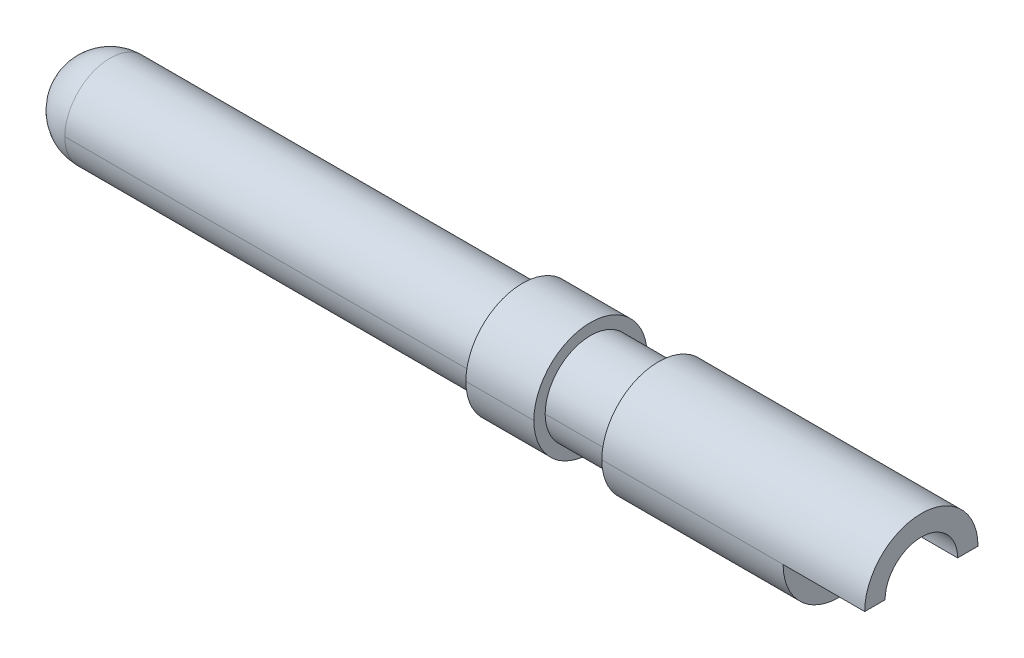
ISO-10303-21;
HEADER;
FILE_DESCRIPTION(('STEP AP214'),'2;1');
FILE_NAME('part.step','',(''),(''),'','','');
FILE_SCHEMA(('AUTOMOTIVE_DESIGN { 1 0 10303 214 1 1 1 1 }'));
ENDSEC;
DATA;
#1=APPLICATION_CONTEXT('core data for automotive mechanical design processes');
#2=APPLICATION_PROTOCOL_DEFINITION('international standard','automotive_design',2000,#1);
#3=PRODUCT_CONTEXT('',#1,'mechanical');
#4=PRODUCT('Part','Part','',(#3));
#5=PRODUCT_RELATED_PRODUCT_CATEGORY('part','',(#4));
#6=PRODUCT_DEFINITION_FORMATION('','',#4);
#7=PRODUCT_DEFINITION_CONTEXT('part definition',#1,'design');
#8=PRODUCT_DEFINITION('design','',#6,#7);
#9=PRODUCT_DEFINITION_SHAPE('','',#8);
#10=(LENGTH_UNIT() NAMED_UNIT(*) SI_UNIT(.MILLI.,.METRE.));
#11=(NAMED_UNIT(*) PLANE_ANGLE_UNIT() SI_UNIT($,.RADIAN.));
#12=(NAMED_UNIT(*) SI_UNIT($,.STERADIAN.) SOLID_ANGLE_UNIT());
#13=UNCERTAINTY_MEASURE_WITH_UNIT(LENGTH_MEASURE(1.E-05),#10,'distance_accuracy_value','');
#14=(GEOMETRIC_REPRESENTATION_CONTEXT(3) GLOBAL_UNCERTAINTY_ASSIGNED_CONTEXT((#13)) GLOBAL_UNIT_ASSIGNED_CONTEXT((#10,
#11,#12)) REPRESENTATION_CONTEXT('',''));
#15=CARTESIAN_POINT('',(0.,0.,0.));
#16=DIRECTION('',(0.,0.,1.));
#17=DIRECTION('',(1.,0.,0.));
#18=AXIS2_PLACEMENT_3D('',#15,#16,#17);
#19=CARTESIAN_POINT('',(-2.00000000012324,0.,0.));
#20=DIRECTION('',(1.,0.,0.));
#21=DIRECTION('',(0.,0.,-1.));
#22=AXIS2_PLACEMENT_3D('',#19,#20,#21);
#23=CONICAL_SURFACE('',#22,0.799999999799184,1.0471975507193);
#24=DIRECTION('',(0.500000000413349,0.,0.866025403545792));
#25=VECTOR('',#24,1.);
#26=CARTESIAN_POINT('',(-2.00000000012324,0.,0.799999999799184));
#27=LINE('',#26,#25);
#28=CARTESIAN_POINT('',(-2.46188021543503,2.8421709430404E-10,0.));
#29=VERTEX_POINT('',#28);
#30=CARTESIAN_POINT('',(-2.,0.,0.800000000012639));
#31=VERTEX_POINT('',#30);
#32=EDGE_CURVE('E192',#29,#31,#27,.T.);
#33=ORIENTED_EDGE('',*,*,#32,.F.);
#34=DIRECTION('',(0.500000000413349,0.,-0.866025403545792));
#35=VECTOR('',#34,1.);
#36=CARTESIAN_POINT('',(-2.00000000012324,0.,-0.799999999799184));
#37=LINE('',#36,#35);
#38=CARTESIAN_POINT('',(-2.,0.,-0.800000000012639));
#39=VERTEX_POINT('',#38);
#40=EDGE_CURVE('E197',#29,#39,#37,.T.);
#41=ORIENTED_EDGE('',*,*,#40,.T.);
#42=CARTESIAN_POINT('',(-2.,0.,0.));
#43=DIRECTION('',(1.,0.,0.));
#44=DIRECTION('',(0.,0.,-1.));
#45=AXIS2_PLACEMENT_3D('',#42,#43,#44);
#46=CIRCLE('',#45,0.8);
#47=EDGE_CURVE('E11',#39,#31,#46,.T.);
#48=ORIENTED_EDGE('',*,*,#47,.T.);
#49=EDGE_LOOP('',(#33,#41,#48));
#50=FACE_BOUND('',#49,.T.);
#51=ADVANCED_FACE('F17',(#50),#23,.F.);
#52=CARTESIAN_POINT('',(-19.845,0.,0.));
#53=DIRECTION('',(1.,0.,0.));
#54=DIRECTION('',(0.,0.,-1.));
#55=AXIS2_PLACEMENT_3D('',#52,#53,#54);
#56=CYLINDRICAL_SURFACE('',#55,0.8);
#57=DIRECTION('',(1.,0.,0.));
#58=VECTOR('',#57,1.);
#59=CARTESIAN_POINT('',(-19.845,0.,0.8));
#60=LINE('',#59,#58);
#61=CARTESIAN_POINT('',(-1.8,0.,0.8));
#62=VERTEX_POINT('',#61);
#63=EDGE_CURVE('E179',#31,#62,#60,.T.);
#64=ORIENTED_EDGE('',*,*,#63,.F.);
#65=ORIENTED_EDGE('',*,*,#47,.F.);
#66=DIRECTION('',(1.,0.,0.));
#67=VECTOR('',#66,1.);
#68=CARTESIAN_POINT('',(-19.845,0.,-0.8));
#69=LINE('',#68,#67);
#70=CARTESIAN_POINT('',(-1.8,0.,-0.8));
#71=VERTEX_POINT('',#70);
#72=EDGE_CURVE('E217',#39,#71,#69,.T.);
#73=ORIENTED_EDGE('',*,*,#72,.T.);
#74=DIRECTION('',(1.,0.,0.));
#75=VECTOR('',#74,1.);
#76=CARTESIAN_POINT('',(0.,0.,-0.8));
#77=LINE('',#76,#75);
#78=CARTESIAN_POINT('',(0.,0.,-0.8));
#79=VERTEX_POINT('',#78);
#80=EDGE_CURVE('E28',#71,#79,#77,.T.);
#81=ORIENTED_EDGE('',*,*,#80,.T.);
#82=CARTESIAN_POINT('',(0.,0.,0.));
#83=DIRECTION('',(-1.,0.,0.));
#84=DIRECTION('',(0.,0.,-1.));
#85=AXIS2_PLACEMENT_3D('',#82,#83,#84);
#86=CIRCLE('',#85,0.8);
#87=CARTESIAN_POINT('',(0.,0.,0.8));
#88=VERTEX_POINT('',#87);
#89=EDGE_CURVE('E203',#88,#79,#86,.T.);
#90=ORIENTED_EDGE('',*,*,#89,.F.);
#91=DIRECTION('',(-1.,0.,0.));
#92=VECTOR('',#91,1.);
#93=CARTESIAN_POINT('',(0.,0.,0.8));
#94=LINE('',#93,#92);
#95=EDGE_CURVE('E43',#88,#62,#94,.T.);
#96=ORIENTED_EDGE('',*,*,#95,.T.);
#97=EDGE_LOOP('',(#64,#65,#73,#81,#90,#96));
#98=FACE_BOUND('',#97,.T.);
#99=ADVANCED_FACE('F319',(#98),#56,.F.);
#100=CARTESIAN_POINT('',(0.,0.,2.405));
#101=DIRECTION('',(0.,1.,0.));
#102=DIRECTION('',(1.,0.,0.));
#103=AXIS2_PLACEMENT_3D('',#100,#101,#102);
#104=PLANE('',#103);
#105=DIRECTION('',(0.,0.,-1.));
#106=VECTOR('',#105,1.);
#107=CARTESIAN_POINT('',(-1.8,0.,2.405));
#108=LINE('',#107,#106);
#109=CARTESIAN_POINT('',(-1.8,0.,-1.25));
#110=VERTEX_POINT('',#109);
#111=EDGE_CURVE('E174',#71,#110,#108,.T.);
#112=ORIENTED_EDGE('',*,*,#111,.T.);
#113=DIRECTION('',(-1.,0.,0.));
#114=VECTOR('',#113,1.);
#115=CARTESIAN_POINT('',(-19.845,0.,-1.25));
#116=LINE('',#115,#114);
#117=CARTESIAN_POINT('',(0.,0.,-1.25));
#118=VERTEX_POINT('',#117);
#119=EDGE_CURVE('E185',#118,#110,#116,.T.);
#120=ORIENTED_EDGE('',*,*,#119,.F.);
#121=DIRECTION('',(0.,0.,-1.));
#122=VECTOR('',#121,1.);
#123=CARTESIAN_POINT('',(0.,0.,0.));
#124=LINE('',#123,#122);
#125=EDGE_CURVE('E257',#79,#118,#124,.T.);
#126=ORIENTED_EDGE('',*,*,#125,.F.);
#127=ORIENTED_EDGE('',*,*,#80,.F.);
#128=EDGE_LOOP('',(#112,#120,#126,#127));
#129=FACE_BOUND('',#128,.T.);
#130=ADVANCED_FACE('F324',(#129),#104,.F.);
#131=CARTESIAN_POINT('',(-1.8,0.,2.405));
#132=DIRECTION('',(-1.,0.,0.));
#133=DIRECTION('',(0.,0.,1.));
#134=AXIS2_PLACEMENT_3D('',#131,#132,#133);
#135=PLANE('',#134);
#136=ORIENTED_EDGE('',*,*,#111,.F.);
#137=CARTESIAN_POINT('',(-1.8,0.,0.));
#138=DIRECTION('',(1.,0.,0.));
#139=DIRECTION('',(0.,0.,-1.));
#140=AXIS2_PLACEMENT_3D('',#137,#138,#139);
#141=CIRCLE('',#140,0.8);
#142=EDGE_CURVE('E221',#62,#71,#141,.T.);
#143=ORIENTED_EDGE('',*,*,#142,.F.);
#144=DIRECTION('',(0.,0.,1.));
#145=VECTOR('',#144,1.);
#146=CARTESIAN_POINT('',(-1.8,0.,2.405));
#147=LINE('',#146,#145);
#148=CARTESIAN_POINT('',(-1.8,0.,1.25));
#149=VERTEX_POINT('',#148);
#150=EDGE_CURVE('E207',#62,#149,#147,.T.);
#151=ORIENTED_EDGE('',*,*,#150,.T.);
#152=CARTESIAN_POINT('',(-1.8,0.,0.));
#153=DIRECTION('',(-1.,0.,0.));
#154=DIRECTION('',(0.,0.,-1.));
#155=AXIS2_PLACEMENT_3D('',#152,#153,#154);
#156=CIRCLE('',#155,1.25);
#157=EDGE_CURVE('E278',#110,#149,#156,.T.);
#158=ORIENTED_EDGE('',*,*,#157,.F.);
#159=EDGE_LOOP('',(#136,#143,#151,#158));
#160=FACE_BOUND('',#159,.T.);
#161=ADVANCED_FACE('F19',(#160),#135,.F.);
#162=CARTESIAN_POINT('',(0.,0.,2.405));
#163=DIRECTION('',(0.,1.,0.));
#164=DIRECTION('',(1.,0.,0.));
#165=AXIS2_PLACEMENT_3D('',#162,#163,#164);
#166=PLANE('',#165);
#167=ORIENTED_EDGE('',*,*,#150,.F.);
#168=ORIENTED_EDGE('',*,*,#95,.F.);
#169=DIRECTION('',(0.,0.,-1.));
#170=VECTOR('',#169,1.);
#171=CARTESIAN_POINT('',(0.,0.,0.));
#172=LINE('',#171,#170);
#173=CARTESIAN_POINT('',(0.,0.,1.25));
#174=VERTEX_POINT('',#173);
#175=EDGE_CURVE('E208',#174,#88,#172,.T.);
#176=ORIENTED_EDGE('',*,*,#175,.F.);
#177=DIRECTION('',(1.,0.,0.));
#178=VECTOR('',#177,1.);
#179=CARTESIAN_POINT('',(-19.845,0.,1.25));
#180=LINE('',#179,#178);
#181=EDGE_CURVE('E21',#149,#174,#180,.T.);
#182=ORIENTED_EDGE('',*,*,#181,.F.);
#183=EDGE_LOOP('',(#167,#168,#176,#182));
#184=FACE_BOUND('',#183,.T.);
#185=ADVANCED_FACE('F375',(#184),#166,.F.);
#186=CARTESIAN_POINT('',(0.,0.,0.));
#187=DIRECTION('',(1.,0.,0.));
#188=DIRECTION('',(0.,1.,0.));
#189=AXIS2_PLACEMENT_3D('',#186,#187,#188);
#190=PLANE('',#189);
#191=ORIENTED_EDGE('',*,*,#125,.T.);
#192=CARTESIAN_POINT('',(0.,0.,0.));
#193=DIRECTION('',(-1.,0.,0.));
#194=DIRECTION('',(0.,0.,-1.));
#195=AXIS2_PLACEMENT_3D('',#192,#193,#194);
#196=CIRCLE('',#195,1.25);
#197=EDGE_CURVE('E181',#174,#118,#196,.T.);
#198=ORIENTED_EDGE('',*,*,#197,.F.);
#199=ORIENTED_EDGE('',*,*,#175,.T.);
#200=ORIENTED_EDGE('',*,*,#89,.T.);
#201=EDGE_LOOP('',(#191,#198,#199,#200));
#202=FACE_BOUND('',#201,.T.);
#203=ADVANCED_FACE('F314',(#202),#190,.T.);
#204=CARTESIAN_POINT('',(-19.845,0.,0.));
#205=DIRECTION('',(1.,0.,0.));
#206=DIRECTION('',(0.,0.,-1.));
#207=AXIS2_PLACEMENT_3D('',#204,#205,#206);
#208=CYLINDRICAL_SURFACE('',#207,1.25);
#209=DIRECTION('',(1.,0.,0.));
#210=VECTOR('',#209,1.);
#211=CARTESIAN_POINT('',(-19.845,0.,1.25));
#212=LINE('',#211,#210);
#213=CARTESIAN_POINT('',(-5.8,0.,1.25));
#214=VERTEX_POINT('',#213);
#215=EDGE_CURVE('E225',#214,#149,#212,.T.);
#216=ORIENTED_EDGE('',*,*,#215,.F.);
#217=CARTESIAN_POINT('',(-5.8,0.,0.));
#218=DIRECTION('',(1.,0.,0.));
#219=DIRECTION('',(0.,0.,-1.));
#220=AXIS2_PLACEMENT_3D('',#217,#218,#219);
#221=CIRCLE('',#220,1.25);
#222=CARTESIAN_POINT('',(-5.8,0.,-1.25));
#223=VERTEX_POINT('',#222);
#224=EDGE_CURVE('E231',#214,#223,#221,.T.);
#225=ORIENTED_EDGE('',*,*,#224,.T.);
#226=DIRECTION('',(1.,0.,0.));
#227=VECTOR('',#226,1.);
#228=CARTESIAN_POINT('',(-19.845,0.,-1.25));
#229=LINE('',#228,#227);
#230=EDGE_CURVE('E180',#223,#110,#229,.T.);
#231=ORIENTED_EDGE('',*,*,#230,.T.);
#232=ORIENTED_EDGE('',*,*,#157,.T.);
#233=EDGE_LOOP('',(#216,#225,#231,#232));
#234=FACE_BOUND('',#233,.T.);
#235=ADVANCED_FACE('F293',(#234),#208,.T.);
#236=CARTESIAN_POINT('',(-5.8,0.,0.));
#237=DIRECTION('',(1.,0.,0.));
#238=DIRECTION('',(0.,1.,0.));
#239=AXIS2_PLACEMENT_3D('',#236,#237,#238);
#240=PLANE('',#239);
#241=CARTESIAN_POINT('',(-5.8,0.,0.));
#242=DIRECTION('',(-1.,0.,0.));
#243=DIRECTION('',(0.,0.,-1.));
#244=AXIS2_PLACEMENT_3D('',#241,#242,#243);
#245=CIRCLE('',#244,1.);
#246=CARTESIAN_POINT('',(-5.8,0.,-1.));
#247=VERTEX_POINT('',#246);
#248=CARTESIAN_POINT('',(-5.8,0.,1.));
#249=VERTEX_POINT('',#248);
#250=EDGE_CURVE('E228',#247,#249,#245,.T.);
#251=ORIENTED_EDGE('',*,*,#250,.F.);
#252=CARTESIAN_POINT('',(-5.8,0.,0.));
#253=DIRECTION('',(-1.,0.,0.));
#254=DIRECTION('',(0.,0.,-1.));
#255=AXIS2_PLACEMENT_3D('',#252,#253,#254);
#256=CIRCLE('',#255,1.);
#257=EDGE_CURVE('E216',#249,#247,#256,.T.);
#258=ORIENTED_EDGE('',*,*,#257,.F.);
#259=EDGE_LOOP('',(#251,#258));
#260=FACE_BOUND('',#259,.T.);
#261=CARTESIAN_POINT('',(-5.8,0.,0.));
#262=DIRECTION('',(1.,0.,0.));
#263=DIRECTION('',(0.,0.,-1.));
#264=AXIS2_PLACEMENT_3D('',#261,#262,#263);
#265=CIRCLE('',#264,1.25);
#266=EDGE_CURVE('E215',#223,#214,#265,.T.);
#267=ORIENTED_EDGE('',*,*,#266,.F.);
#268=ORIENTED_EDGE('',*,*,#224,.F.);
#269=EDGE_LOOP('',(#267,#268));
#270=FACE_BOUND('',#269,.T.);
#271=ADVANCED_FACE('F301',(#260,#270),#240,.F.);
#272=CARTESIAN_POINT('',(-19.845,0.,0.));
#273=DIRECTION('',(1.,0.,0.));
#274=DIRECTION('',(0.,0.,-1.));
#275=AXIS2_PLACEMENT_3D('',#272,#273,#274);
#276=CYLINDRICAL_SURFACE('',#275,1.);
#277=DIRECTION('',(1.,0.,0.));
#278=VECTOR('',#277,1.);
#279=CARTESIAN_POINT('',(-19.845,0.,1.));
#280=LINE('',#279,#278);
#281=CARTESIAN_POINT('',(-7.3,0.,1.));
#282=VERTEX_POINT('',#281);
#283=EDGE_CURVE('E272',#282,#249,#280,.T.);
#284=ORIENTED_EDGE('',*,*,#283,.F.);
#285=CARTESIAN_POINT('',(-7.3,0.,0.));
#286=DIRECTION('',(-1.,0.,0.));
#287=DIRECTION('',(0.,0.,-1.));
#288=AXIS2_PLACEMENT_3D('',#285,#286,#287);
#289=CIRCLE('',#288,1.);
#290=CARTESIAN_POINT('',(-7.3,0.,-1.));
#291=VERTEX_POINT('',#290);
#292=EDGE_CURVE('E232',#291,#282,#289,.T.);
#293=ORIENTED_EDGE('',*,*,#292,.F.);
#294=DIRECTION('',(1.,0.,0.));
#295=VECTOR('',#294,1.);
#296=CARTESIAN_POINT('',(-19.845,0.,-1.));
#297=LINE('',#296,#295);
#298=EDGE_CURVE('E211',#291,#247,#297,.T.);
#299=ORIENTED_EDGE('',*,*,#298,.T.);
#300=ORIENTED_EDGE('',*,*,#250,.T.);
#301=EDGE_LOOP('',(#284,#293,#299,#300));
#302=FACE_BOUND('',#301,.T.);
#303=ADVANCED_FACE('F303',(#302),#276,.T.);
#304=CARTESIAN_POINT('',(-7.3,0.,0.));
#305=DIRECTION('',(1.,0.,0.));
#306=DIRECTION('',(0.,1.,0.));
#307=AXIS2_PLACEMENT_3D('',#304,#305,#306);
#308=PLANE('',#307);
#309=ORIENTED_EDGE('',*,*,#292,.T.);
#310=CARTESIAN_POINT('',(-7.3,0.,0.));
#311=DIRECTION('',(-1.,0.,0.));
#312=DIRECTION('',(0.,0.,-1.));
#313=AXIS2_PLACEMENT_3D('',#310,#311,#312);
#314=CIRCLE('',#313,1.);
#315=EDGE_CURVE('E190',#282,#291,#314,.T.);
#316=ORIENTED_EDGE('',*,*,#315,.T.);
#317=EDGE_LOOP('',(#309,#316));
#318=FACE_BOUND('',#317,.T.);
#319=CARTESIAN_POINT('',(-7.3,0.,0.));
#320=DIRECTION('',(-1.,0.,0.));
#321=DIRECTION('',(0.,0.,-1.));
#322=AXIS2_PLACEMENT_3D('',#319,#320,#321);
#323=CIRCLE('',#322,1.25);
#324=CARTESIAN_POINT('',(-7.3,0.,-1.25));
#325=VERTEX_POINT('',#324);
#326=CARTESIAN_POINT('',(-7.3,0.,1.25));
#327=VERTEX_POINT('',#326);
#328=EDGE_CURVE('E236',#325,#327,#323,.T.);
#329=ORIENTED_EDGE('',*,*,#328,.F.);
#330=CARTESIAN_POINT('',(-7.3,0.,0.));
#331=DIRECTION('',(-1.,0.,0.));
#332=DIRECTION('',(0.,0.,-1.));
#333=AXIS2_PLACEMENT_3D('',#330,#331,#332);
#334=CIRCLE('',#333,1.25);
#335=EDGE_CURVE('E191',#327,#325,#334,.T.);
#336=ORIENTED_EDGE('',*,*,#335,.F.);
#337=EDGE_LOOP('',(#329,#336));
#338=FACE_BOUND('',#337,.T.);
#339=ADVANCED_FACE('F311',(#318,#338),#308,.T.);
#340=CARTESIAN_POINT('',(-19.845,0.,0.));
#341=DIRECTION('',(1.,0.,0.));
#342=DIRECTION('',(0.,0.,-1.));
#343=AXIS2_PLACEMENT_3D('',#340,#341,#342);
#344=CYLINDRICAL_SURFACE('',#343,1.25);
#345=DIRECTION('',(1.,0.,0.));
#346=VECTOR('',#345,1.);
#347=CARTESIAN_POINT('',(-19.845,0.,1.25));
#348=LINE('',#347,#346);
#349=CARTESIAN_POINT('',(-8.8,0.,1.25));
#350=VERTEX_POINT('',#349);
#351=EDGE_CURVE('E198',#350,#327,#348,.T.);
#352=ORIENTED_EDGE('',*,*,#351,.F.);
#353=CARTESIAN_POINT('',(-8.8,0.,0.));
#354=DIRECTION('',(1.,0.,0.));
#355=DIRECTION('',(0.,0.,-1.));
#356=AXIS2_PLACEMENT_3D('',#353,#354,#355);
#357=CIRCLE('',#356,1.25);
#358=CARTESIAN_POINT('',(-8.8,0.,-1.25));
#359=VERTEX_POINT('',#358);
#360=EDGE_CURVE('E149',#350,#359,#357,.T.);
#361=ORIENTED_EDGE('',*,*,#360,.T.);
#362=DIRECTION('',(1.,0.,0.));
#363=VECTOR('',#362,1.);
#364=CARTESIAN_POINT('',(-19.845,0.,-1.25));
#365=LINE('',#364,#363);
#366=EDGE_CURVE('E186',#359,#325,#365,.T.);
#367=ORIENTED_EDGE('',*,*,#366,.T.);
#368=ORIENTED_EDGE('',*,*,#328,.T.);
#369=EDGE_LOOP('',(#352,#361,#367,#368));
#370=FACE_BOUND('',#369,.T.);
#371=ADVANCED_FACE('F355',(#370),#344,.T.);
#372=CARTESIAN_POINT('',(-17.9,-1.,0.));
#373=CARTESIAN_POINT('',(-17.9,-1.,0.));
#374=CARTESIAN_POINT('',(-17.9,-1.,0.));
#375=CARTESIAN_POINT('',(-17.9,-1.,0.));
#376=CARTESIAN_POINT('',(-17.9,-1.,2.));
#377=CARTESIAN_POINT('',(-21.9,-1.,2.));
#378=CARTESIAN_POINT('',(-21.9,-1.,-2.));
#379=CARTESIAN_POINT('',(-17.9,-1.,-2.));
#380=CARTESIAN_POINT('',(-17.9,1.,2.));
#381=CARTESIAN_POINT('',(-21.9,0.999999999999998,2.));
#382=CARTESIAN_POINT('',(-21.9,0.999999999999998,-2.));
#383=CARTESIAN_POINT('',(-17.9,1.,-2.));
#384=CARTESIAN_POINT('',(-17.9,1.,0.));
#385=CARTESIAN_POINT('',(-17.9,1.,0.));
#386=CARTESIAN_POINT('',(-17.9,1.,0.));
#387=CARTESIAN_POINT('',(-17.9,1.,0.));
#388=(BOUNDED_SURFACE() B_SPLINE_SURFACE(3,3,((#372,#373,#374,#375),(#376,#377,#378,#379),(#380,
#381,#382,#383),(#384,#385,#386,#387)),.UNSPECIFIED.,.F.,.F.,
.F.) B_SPLINE_SURFACE_WITH_KNOTS((4,4),(4,4),(0.,1.),(0.,1.),
.UNSPECIFIED.) GEOMETRIC_REPRESENTATION_ITEM() RATIONAL_B_SPLINE_SURFACE(((1.,0.333333333333334,
0.333333333333334,1.),(0.333333333333334,0.111111111111111,0.111111111111111,0.333333333333334),
(0.333333333333334,0.111111111111111,0.111111111111111,0.333333333333334),(1.,0.333333333333334,
0.333333333333334,1.))) REPRESENTATION_ITEM('') SURFACE());
#389=CARTESIAN_POINT('',(-17.9,0.,0.));
#390=DIRECTION('',(1.,0.,0.));
#391=DIRECTION('',(0.,0.,-1.));
#392=AXIS2_PLACEMENT_3D('',#389,#390,#391);
#393=CIRCLE('',#392,1.);
#394=CARTESIAN_POINT('',(-17.9,-1.,0.));
#395=VERTEX_POINT('',#394);
#396=CARTESIAN_POINT('',(-17.9,0.,-1.));
#397=VERTEX_POINT('',#396);
#398=EDGE_CURVE('E150',#395,#397,#393,.T.);
#399=CARTESIAN_POINT('',(-17.9,0.,0.));
#400=DIRECTION('',(1.,0.,0.));
#401=DIRECTION('',(0.,0.,-1.));
#402=AXIS2_PLACEMENT_3D('',#399,#400,#401);
#403=CIRCLE('',#402,1.);
#404=CARTESIAN_POINT('',(-17.9,0.,1.));
#405=VERTEX_POINT('',#404);
#406=EDGE_CURVE('E196',#405,#395,#403,.T.);
#407=CARTESIAN_POINT('',(-17.9,0.,0.));
#408=DIRECTION('',(1.,0.,0.));
#409=DIRECTION('',(0.,0.,-1.));
#410=AXIS2_PLACEMENT_3D('',#407,#408,#409);
#411=CIRCLE('',#410,1.);
#412=CARTESIAN_POINT('',(-17.9,1.,0.));
#413=VERTEX_POINT('',#412);
#414=EDGE_CURVE('E170',#413,#405,#411,.T.);
#415=CARTESIAN_POINT('',(-17.9,0.,0.));
#416=DIRECTION('',(1.,0.,0.));
#417=DIRECTION('',(0.,0.,-1.));
#418=AXIS2_PLACEMENT_3D('',#415,#416,#417);
#419=CIRCLE('',#418,1.);
#420=EDGE_CURVE('E158',#397,#413,#419,.T.);
#421=ORIENTED_EDGE('',*,*,#398,.F.);
#422=ORIENTED_EDGE('',*,*,#406,.F.);
#423=ORIENTED_EDGE('',*,*,#414,.F.);
#424=ORIENTED_EDGE('',*,*,#420,.F.);
#425=EDGE_LOOP('',(#421,#422,#423,#424));
#426=FACE_BOUND('',#425,.T.);
#427=ADVANCED_FACE('F364',(#426),#388,.T.);
#428=CARTESIAN_POINT('',(-8.8,0.,0.));
#429=DIRECTION('',(1.,0.,0.));
#430=DIRECTION('',(0.,1.,0.));
#431=AXIS2_PLACEMENT_3D('',#428,#429,#430);
#432=PLANE('',#431);
#433=CARTESIAN_POINT('',(-8.8,0.,0.));
#434=DIRECTION('',(-1.,0.,0.));
#435=DIRECTION('',(0.,0.,-1.));
#436=AXIS2_PLACEMENT_3D('',#433,#434,#435);
#437=CIRCLE('',#436,1.);
#438=CARTESIAN_POINT('',(-8.8,0.,-1.));
#439=VERTEX_POINT('',#438);
#440=CARTESIAN_POINT('',(-8.8,0.,1.));
#441=VERTEX_POINT('',#440);
#442=EDGE_CURVE('E139',#439,#441,#437,.T.);
#443=ORIENTED_EDGE('',*,*,#442,.F.);
#444=CARTESIAN_POINT('',(-8.8,0.,0.));
#445=DIRECTION('',(-1.,0.,0.));
#446=DIRECTION('',(0.,0.,-1.));
#447=AXIS2_PLACEMENT_3D('',#444,#445,#446);
#448=CIRCLE('',#447,1.);
#449=EDGE_CURVE('E144',#441,#439,#448,.T.);
#450=ORIENTED_EDGE('',*,*,#449,.F.);
#451=EDGE_LOOP('',(#443,#450));
#452=FACE_BOUND('',#451,.T.);
#453=CARTESIAN_POINT('',(-8.8,0.,0.));
#454=DIRECTION('',(1.,0.,0.));
#455=DIRECTION('',(0.,0.,-1.));
#456=AXIS2_PLACEMENT_3D('',#453,#454,#455);
#457=CIRCLE('',#456,1.25);
#458=EDGE_CURVE('E202',#359,#350,#457,.T.);
#459=ORIENTED_EDGE('',*,*,#458,.F.);
#460=ORIENTED_EDGE('',*,*,#360,.F.);
#461=EDGE_LOOP('',(#459,#460));
#462=FACE_BOUND('',#461,.T.);
#463=ADVANCED_FACE('F141',(#452,#462),#432,.F.);
#464=CARTESIAN_POINT('',(-19.845,0.,0.));
#465=DIRECTION('',(1.,0.,0.));
#466=DIRECTION('',(0.,0.,-1.));
#467=AXIS2_PLACEMENT_3D('',#464,#465,#466);
#468=CYLINDRICAL_SURFACE('',#467,1.);
#469=DIRECTION('',(1.,0.,0.));
#470=VECTOR('',#469,1.);
#471=CARTESIAN_POINT('',(-19.845,0.,1.));
#472=LINE('',#471,#470);
#473=EDGE_CURVE('E162',#405,#441,#472,.T.);
#474=ORIENTED_EDGE('',*,*,#473,.F.);
#475=ORIENTED_EDGE('',*,*,#406,.T.);
#476=ORIENTED_EDGE('',*,*,#398,.T.);
#477=DIRECTION('',(1.,0.,0.));
#478=VECTOR('',#477,1.);
#479=CARTESIAN_POINT('',(-19.845,0.,-1.));
#480=LINE('',#479,#478);
#481=EDGE_CURVE('E152',#397,#439,#480,.T.);
#482=ORIENTED_EDGE('',*,*,#481,.T.);
#483=ORIENTED_EDGE('',*,*,#442,.T.);
#484=EDGE_LOOP('',(#474,#475,#476,#482,#483));
#485=FACE_BOUND('',#484,.T.);
#486=ADVANCED_FACE('F153',(#485),#468,.T.);
#487=CARTESIAN_POINT('',(-2.00000000012324,0.,0.));
#488=DIRECTION('',(1.,0.,0.));
#489=DIRECTION('',(0.,0.,-1.));
#490=AXIS2_PLACEMENT_3D('',#487,#488,#489);
#491=CONICAL_SURFACE('',#490,0.799999999799184,1.0471975507193);
#492=ORIENTED_EDGE('',*,*,#40,.F.);
#493=ORIENTED_EDGE('',*,*,#32,.T.);
#494=CARTESIAN_POINT('',(-2.,0.,0.));
#495=DIRECTION('',(1.,0.,0.));
#496=DIRECTION('',(0.,0.,-1.));
#497=AXIS2_PLACEMENT_3D('',#494,#495,#496);
#498=CIRCLE('',#497,0.8);
#499=EDGE_CURVE('E176',#31,#39,#498,.T.);
#500=ORIENTED_EDGE('',*,*,#499,.T.);
#501=EDGE_LOOP('',(#492,#493,#500));
#502=FACE_BOUND('',#501,.T.);
#503=ADVANCED_FACE('F330',(#502),#491,.F.);
#504=CARTESIAN_POINT('',(-19.845,0.,0.));
#505=DIRECTION('',(1.,0.,0.));
#506=DIRECTION('',(0.,0.,-1.));
#507=AXIS2_PLACEMENT_3D('',#504,#505,#506);
#508=CYLINDRICAL_SURFACE('',#507,0.8);
#509=ORIENTED_EDGE('',*,*,#499,.F.);
#510=ORIENTED_EDGE('',*,*,#63,.T.);
#511=ORIENTED_EDGE('',*,*,#142,.T.);
#512=ORIENTED_EDGE('',*,*,#72,.F.);
#513=EDGE_LOOP('',(#509,#510,#511,#512));
#514=FACE_BOUND('',#513,.T.);
#515=ADVANCED_FACE('F422',(#514),#508,.F.);
#516=CARTESIAN_POINT('',(-19.845,0.,0.));
#517=DIRECTION('',(1.,0.,0.));
#518=DIRECTION('',(0.,0.,-1.));
#519=AXIS2_PLACEMENT_3D('',#516,#517,#518);
#520=CYLINDRICAL_SURFACE('',#519,1.25);
#521=ORIENTED_EDGE('',*,*,#266,.T.);
#522=ORIENTED_EDGE('',*,*,#215,.T.);
#523=ORIENTED_EDGE('',*,*,#181,.T.);
#524=ORIENTED_EDGE('',*,*,#197,.T.);
#525=ORIENTED_EDGE('',*,*,#119,.T.);
#526=ORIENTED_EDGE('',*,*,#230,.F.);
#527=EDGE_LOOP('',(#521,#522,#523,#524,#525,#526));
#528=FACE_BOUND('',#527,.T.);
#529=ADVANCED_FACE('F297',(#528),#520,.T.);
#530=CARTESIAN_POINT('',(-19.845,0.,0.));
#531=DIRECTION('',(1.,0.,0.));
#532=DIRECTION('',(0.,0.,-1.));
#533=AXIS2_PLACEMENT_3D('',#530,#531,#532);
#534=CYLINDRICAL_SURFACE('',#533,1.);
#535=ORIENTED_EDGE('',*,*,#315,.F.);
#536=ORIENTED_EDGE('',*,*,#283,.T.);
#537=ORIENTED_EDGE('',*,*,#257,.T.);
#538=ORIENTED_EDGE('',*,*,#298,.F.);
#539=EDGE_LOOP('',(#535,#536,#537,#538));
#540=FACE_BOUND('',#539,.T.);
#541=ADVANCED_FACE('F367',(#540),#534,.T.);
#542=CARTESIAN_POINT('',(-19.845,0.,0.));
#543=DIRECTION('',(1.,0.,0.));
#544=DIRECTION('',(0.,0.,-1.));
#545=AXIS2_PLACEMENT_3D('',#542,#543,#544);
#546=CYLINDRICAL_SURFACE('',#545,1.25);
#547=ORIENTED_EDGE('',*,*,#458,.T.);
#548=ORIENTED_EDGE('',*,*,#351,.T.);
#549=ORIENTED_EDGE('',*,*,#335,.T.);
#550=ORIENTED_EDGE('',*,*,#366,.F.);
#551=EDGE_LOOP('',(#547,#548,#549,#550));
#552=FACE_BOUND('',#551,.T.);
#553=ADVANCED_FACE('F352',(#552),#546,.T.);
#554=CARTESIAN_POINT('',(-19.845,0.,0.));
#555=DIRECTION('',(1.,0.,0.));
#556=DIRECTION('',(0.,0.,-1.));
#557=AXIS2_PLACEMENT_3D('',#554,#555,#556);
#558=CYLINDRICAL_SURFACE('',#557,1.);
#559=ORIENTED_EDGE('',*,*,#414,.T.);
#560=ORIENTED_EDGE('',*,*,#473,.T.);
#561=ORIENTED_EDGE('',*,*,#449,.T.);
#562=ORIENTED_EDGE('',*,*,#481,.F.);
#563=ORIENTED_EDGE('',*,*,#420,.T.);
#564=EDGE_LOOP('',(#559,#560,#561,#562,#563));
#565=FACE_BOUND('',#564,.T.);
#566=ADVANCED_FACE('F161',(#565),#558,.T.);
#567=CLOSED_SHELL('',(#51,#99,#130,#161,#185,#203,#235,#271,#303,#339,#371,#427,#463,#486,#503,
#515,#529,#541,#553,#566));
#568=MANIFOLD_SOLID_BREP('B1',#567);
#569=ADVANCED_BREP_SHAPE_REPRESENTATION('',(#18,#568),#14);
#570=SHAPE_DEFINITION_REPRESENTATION(#9,#569);
ENDSEC;
END-ISO-10303-21;
